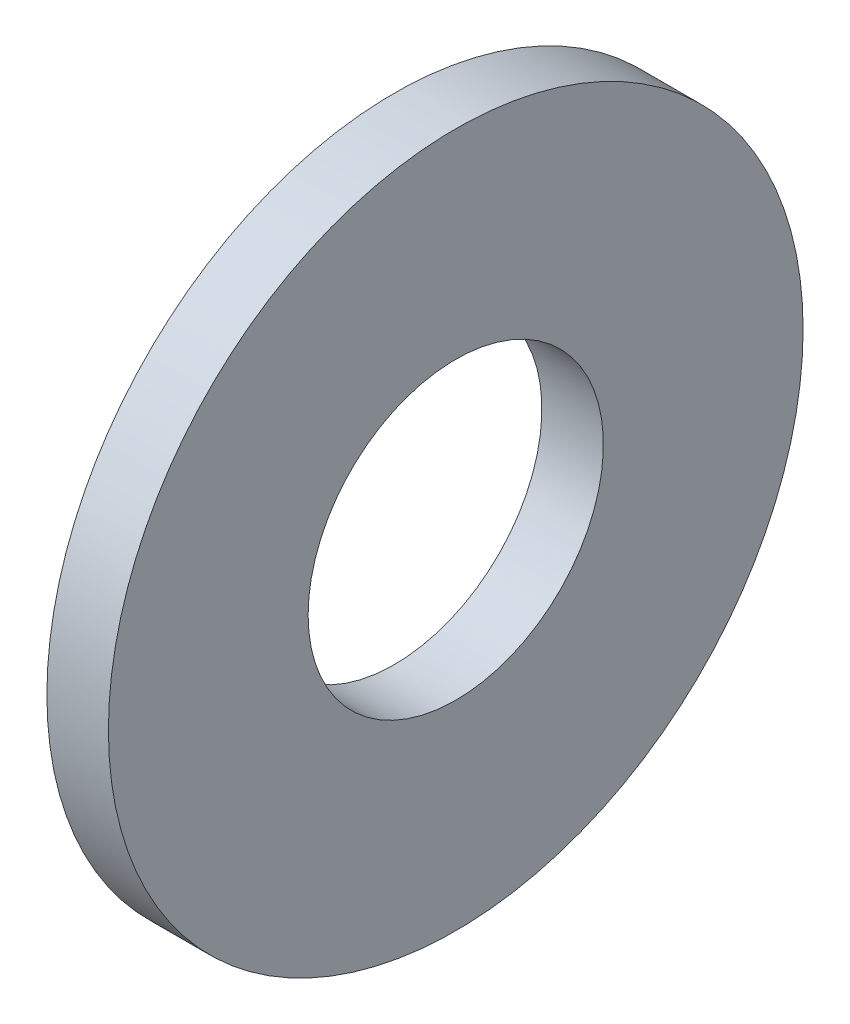
ISO-10303-21;
HEADER;
FILE_DESCRIPTION(('STEP AP214'),'2;1');
FILE_NAME('part.step','',(''),(''),'','','');
FILE_SCHEMA(('AUTOMOTIVE_DESIGN { 1 0 10303 214 1 1 1 1 }'));
ENDSEC;
DATA;
#1=APPLICATION_CONTEXT('core data for automotive mechanical design processes');
#2=APPLICATION_PROTOCOL_DEFINITION('international standard','automotive_design',2000,#1);
#3=PRODUCT_CONTEXT('',#1,'mechanical');
#4=PRODUCT('Part','Part','',(#3));
#5=PRODUCT_RELATED_PRODUCT_CATEGORY('part','',(#4));
#6=PRODUCT_DEFINITION_FORMATION('','',#4);
#7=PRODUCT_DEFINITION_CONTEXT('part definition',#1,'design');
#8=PRODUCT_DEFINITION('design','',#6,#7);
#9=PRODUCT_DEFINITION_SHAPE('','',#8);
#10=(LENGTH_UNIT() NAMED_UNIT(*) SI_UNIT(.MILLI.,.METRE.));
#11=(NAMED_UNIT(*) PLANE_ANGLE_UNIT() SI_UNIT($,.RADIAN.));
#12=(NAMED_UNIT(*) SI_UNIT($,.STERADIAN.) SOLID_ANGLE_UNIT());
#13=UNCERTAINTY_MEASURE_WITH_UNIT(LENGTH_MEASURE(1.E-05),#10,'distance_accuracy_value','');
#14=(GEOMETRIC_REPRESENTATION_CONTEXT(3) GLOBAL_UNCERTAINTY_ASSIGNED_CONTEXT((#13)) GLOBAL_UNIT_ASSIGNED_CONTEXT((#10,
#11,#12)) REPRESENTATION_CONTEXT('',''));
#15=CARTESIAN_POINT('',(0.,0.,0.));
#16=DIRECTION('',(0.,0.,1.));
#17=DIRECTION('',(1.,0.,0.));
#18=AXIS2_PLACEMENT_3D('',#15,#16,#17);
#19=CARTESIAN_POINT('',(-34.9249999999999,0.,0.));
#20=DIRECTION('',(-1.,0.,0.));
#21=DIRECTION('',(0.,0.,1.));
#22=AXIS2_PLACEMENT_3D('',#19,#20,#21);
#23=CYLINDRICAL_SURFACE('',#22,3.9624);
#24=CARTESIAN_POINT('',(0.,0.,0.));
#25=DIRECTION('',(-1.,0.,0.));
#26=DIRECTION('',(0.,0.,1.));
#27=AXIS2_PLACEMENT_3D('',#24,#25,#26);
#28=CIRCLE('',#27,3.9624);
#29=CARTESIAN_POINT('',(0.,0.,3.9624));
#30=VERTEX_POINT('',#29);
#31=EDGE_CURVE('E10',#30,#30,#28,.T.);
#32=ORIENTED_EDGE('',*,*,#31,.F.);
#33=EDGE_LOOP('',(#32));
#34=FACE_BOUND('',#33,.T.);
#35=CARTESIAN_POINT('',(-1.651,0.,0.));
#36=DIRECTION('',(-1.,0.,0.));
#37=DIRECTION('',(0.,0.,1.));
#38=AXIS2_PLACEMENT_3D('',#35,#36,#37);
#39=CIRCLE('',#38,3.9624);
#40=CARTESIAN_POINT('',(-1.651,0.,3.9624));
#41=VERTEX_POINT('',#40);
#42=EDGE_CURVE('E45',#41,#41,#39,.T.);
#43=ORIENTED_EDGE('',*,*,#42,.T.);
#44=EDGE_LOOP('',(#43));
#45=FACE_BOUND('',#44,.T.);
#46=ADVANCED_FACE('F31',(#34,#45),#23,.F.);
#47=CARTESIAN_POINT('',(0.,3.9624,0.));
#48=DIRECTION('',(-1.,0.,0.));
#49=DIRECTION('',(0.,0.,1.));
#50=AXIS2_PLACEMENT_3D('',#47,#48,#49);
#51=PLANE('',#50);
#52=CARTESIAN_POINT('',(0.,0.,0.));
#53=DIRECTION('',(-1.,0.,0.));
#54=DIRECTION('',(0.,0.,1.));
#55=AXIS2_PLACEMENT_3D('',#52,#53,#54);
#56=CIRCLE('',#55,9.3218);
#57=CARTESIAN_POINT('',(0.,0.,9.3218));
#58=VERTEX_POINT('',#57);
#59=EDGE_CURVE('E37',#58,#58,#56,.T.);
#60=ORIENTED_EDGE('',*,*,#59,.F.);
#61=EDGE_LOOP('',(#60));
#62=FACE_BOUND('',#61,.T.);
#63=ORIENTED_EDGE('',*,*,#31,.T.);
#64=EDGE_LOOP('',(#63));
#65=FACE_BOUND('',#64,.T.);
#66=ADVANCED_FACE('F60',(#62,#65),#51,.F.);
#67=CARTESIAN_POINT('',(-34.9249999999999,0.,0.));
#68=DIRECTION('',(-1.,0.,0.));
#69=DIRECTION('',(0.,0.,1.));
#70=AXIS2_PLACEMENT_3D('',#67,#68,#69);
#71=CYLINDRICAL_SURFACE('',#70,9.3218);
#72=CARTESIAN_POINT('',(-1.651,0.,0.));
#73=DIRECTION('',(-1.,0.,0.));
#74=DIRECTION('',(0.,0.,1.));
#75=AXIS2_PLACEMENT_3D('',#72,#73,#74);
#76=CIRCLE('',#75,9.3218);
#77=CARTESIAN_POINT('',(-1.651,0.,9.3218));
#78=VERTEX_POINT('',#77);
#79=EDGE_CURVE('E41',#78,#78,#76,.T.);
#80=ORIENTED_EDGE('',*,*,#79,.F.);
#81=EDGE_LOOP('',(#80));
#82=FACE_BOUND('',#81,.T.);
#83=ORIENTED_EDGE('',*,*,#59,.T.);
#84=EDGE_LOOP('',(#83));
#85=FACE_BOUND('',#84,.T.);
#86=ADVANCED_FACE('F55',(#82,#85),#71,.T.);
#87=CARTESIAN_POINT('',(-1.651,9.3218,0.));
#88=DIRECTION('',(1.,0.,0.));
#89=DIRECTION('',(0.,0.,-1.));
#90=AXIS2_PLACEMENT_3D('',#87,#88,#89);
#91=PLANE('',#90);
#92=ORIENTED_EDGE('',*,*,#42,.F.);
#93=EDGE_LOOP('',(#92));
#94=FACE_BOUND('',#93,.T.);
#95=ORIENTED_EDGE('',*,*,#79,.T.);
#96=EDGE_LOOP('',(#95));
#97=FACE_BOUND('',#96,.T.);
#98=ADVANCED_FACE('F52',(#94,#97),#91,.F.);
#99=CLOSED_SHELL('',(#46,#66,#86,#98));
#100=MANIFOLD_SOLID_BREP('B2',#99);
#101=ADVANCED_BREP_SHAPE_REPRESENTATION('',(#18,#100),#14);
#102=SHAPE_DEFINITION_REPRESENTATION(#9,#101);
ENDSEC;
END-ISO-10303-21;
